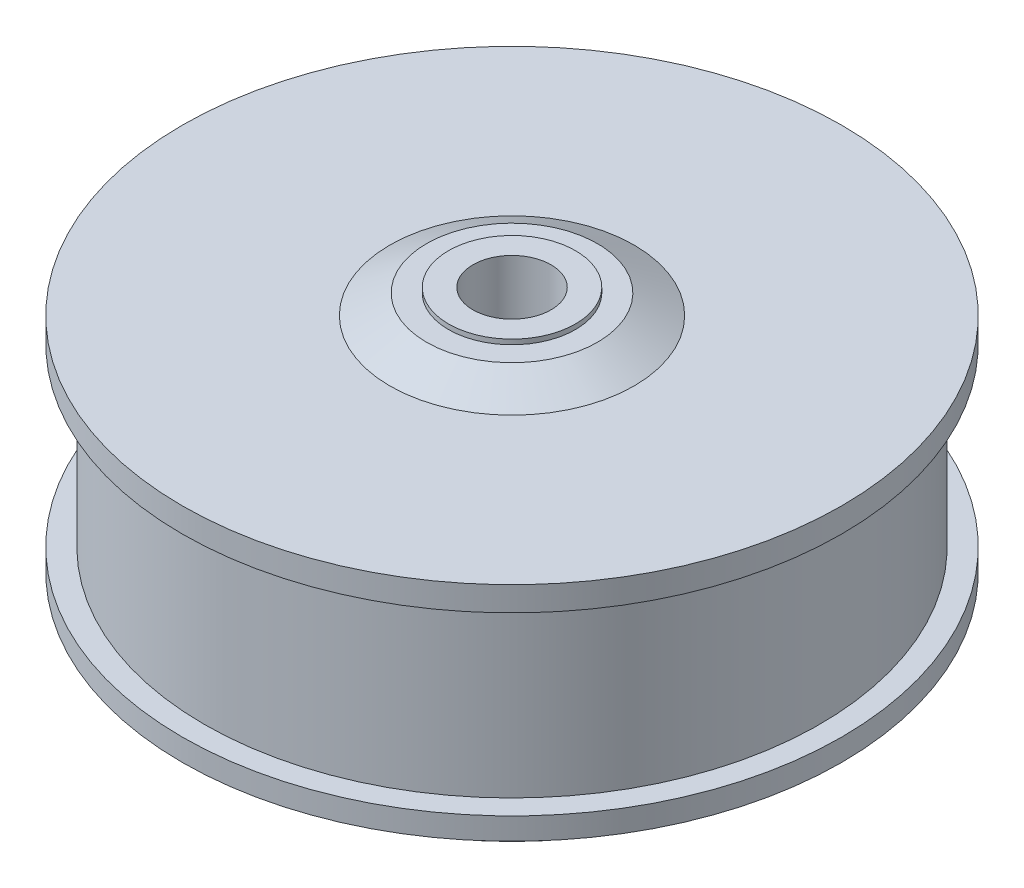
ISO-10303-21;
HEADER;
FILE_DESCRIPTION(('STEP AP214'),'2;1');
FILE_NAME('part.step','',(''),(''),'','','');
FILE_SCHEMA(('AUTOMOTIVE_DESIGN { 1 0 10303 214 1 1 1 1 }'));
ENDSEC;
DATA;
#1=APPLICATION_CONTEXT('core data for automotive mechanical design processes');
#2=APPLICATION_PROTOCOL_DEFINITION('international standard','automotive_design',2000,#1);
#3=PRODUCT_CONTEXT('',#1,'mechanical');
#4=PRODUCT('Part','Part','',(#3));
#5=PRODUCT_RELATED_PRODUCT_CATEGORY('part','',(#4));
#6=PRODUCT_DEFINITION_FORMATION('','',#4);
#7=PRODUCT_DEFINITION_CONTEXT('part definition',#1,'design');
#8=PRODUCT_DEFINITION('design','',#6,#7);
#9=PRODUCT_DEFINITION_SHAPE('','',#8);
#10=(LENGTH_UNIT() NAMED_UNIT(*) SI_UNIT(.MILLI.,.METRE.));
#11=(NAMED_UNIT(*) PLANE_ANGLE_UNIT() SI_UNIT($,.RADIAN.));
#12=(NAMED_UNIT(*) SI_UNIT($,.STERADIAN.) SOLID_ANGLE_UNIT());
#13=UNCERTAINTY_MEASURE_WITH_UNIT(LENGTH_MEASURE(1.E-05),#10,'distance_accuracy_value','');
#14=(GEOMETRIC_REPRESENTATION_CONTEXT(3) GLOBAL_UNCERTAINTY_ASSIGNED_CONTEXT((#13)) GLOBAL_UNIT_ASSIGNED_CONTEXT((#10,
#11,#12)) REPRESENTATION_CONTEXT('',''));
#15=CARTESIAN_POINT('',(0.,0.,0.));
#16=DIRECTION('',(0.,0.,1.));
#17=DIRECTION('',(1.,0.,0.));
#18=AXIS2_PLACEMENT_3D('',#15,#16,#17);
#19=CARTESIAN_POINT('',(13.,61.5,0.));
#20=DIRECTION('',(0.,-1.,0.));
#21=DIRECTION('',(0.,0.,-1.));
#22=AXIS2_PLACEMENT_3D('',#19,#20,#21);
#23=PLANE('',#22);
#24=CARTESIAN_POINT('',(0.,61.5,0.));
#25=DIRECTION('',(0.,1.,0.));
#26=DIRECTION('',(0.,0.,1.));
#27=AXIS2_PLACEMENT_3D('',#24,#25,#26);
#28=CIRCLE('',#27,7.99999999999999);
#29=CARTESIAN_POINT('',(0.,61.5,7.99999999999999));
#30=VERTEX_POINT('',#29);
#31=EDGE_CURVE('E10',#30,#30,#28,.T.);
#32=ORIENTED_EDGE('',*,*,#31,.F.);
#33=EDGE_LOOP('',(#32));
#34=FACE_BOUND('',#33,.T.);
#35=CARTESIAN_POINT('',(0.,61.5,0.));
#36=DIRECTION('',(0.,1.,0.));
#37=DIRECTION('',(0.,0.,1.));
#38=AXIS2_PLACEMENT_3D('',#35,#36,#37);
#39=CIRCLE('',#38,13.);
#40=CARTESIAN_POINT('',(0.,61.5,13.));
#41=VERTEX_POINT('',#40);
#42=EDGE_CURVE('E85',#41,#41,#39,.T.);
#43=ORIENTED_EDGE('',*,*,#42,.T.);
#44=EDGE_LOOP('',(#43));
#45=FACE_BOUND('',#44,.T.);
#46=ADVANCED_FACE('F39',(#34,#45),#23,.F.);
#47=CARTESIAN_POINT('',(0.,20.5,0.));
#48=DIRECTION('',(0.,1.,0.));
#49=DIRECTION('',(0.,0.,1.));
#50=AXIS2_PLACEMENT_3D('',#47,#48,#49);
#51=CYLINDRICAL_SURFACE('',#50,8.);
#52=CARTESIAN_POINT('',(0.,20.5,0.));
#53=DIRECTION('',(0.,1.,0.));
#54=DIRECTION('',(0.,0.,1.));
#55=AXIS2_PLACEMENT_3D('',#52,#53,#54);
#56=CIRCLE('',#55,8.);
#57=CARTESIAN_POINT('',(0.,20.5,8.));
#58=VERTEX_POINT('',#57);
#59=EDGE_CURVE('E45',#58,#58,#56,.T.);
#60=ORIENTED_EDGE('',*,*,#59,.F.);
#61=EDGE_LOOP('',(#60));
#62=FACE_BOUND('',#61,.T.);
#63=ORIENTED_EDGE('',*,*,#31,.T.);
#64=EDGE_LOOP('',(#63));
#65=FACE_BOUND('',#64,.T.);
#66=ADVANCED_FACE('F181',(#62,#65),#51,.F.);
#67=CARTESIAN_POINT('',(8.,20.5,0.));
#68=DIRECTION('',(0.,-1.,0.));
#69=DIRECTION('',(0.,0.,-1.));
#70=AXIS2_PLACEMENT_3D('',#67,#68,#69);
#71=PLANE('',#70);
#72=ORIENTED_EDGE('',*,*,#59,.T.);
#73=EDGE_LOOP('',(#72));
#74=FACE_BOUND('',#73,.T.);
#75=ADVANCED_FACE('F150',(#74),#71,.F.);
#76=CARTESIAN_POINT('',(52.,0.,0.));
#77=DIRECTION('',(0.,1.,0.));
#78=DIRECTION('',(0.,0.,1.));
#79=AXIS2_PLACEMENT_3D('',#76,#77,#78);
#80=PLANE('',#79);
#81=CARTESIAN_POINT('',(0.,0.,27.5));
#82=DIRECTION('',(0.,-1.,0.));
#83=DIRECTION('',(0.,0.,-1.));
#84=AXIS2_PLACEMENT_3D('',#81,#82,#83);
#85=CIRCLE('',#84,2.);
#86=CARTESIAN_POINT('',(0.,0.,25.5));
#87=VERTEX_POINT('',#86);
#88=EDGE_CURVE('E131',#87,#87,#85,.T.);
#89=ORIENTED_EDGE('',*,*,#88,.F.);
#90=EDGE_LOOP('',(#89));
#91=FACE_BOUND('',#90,.T.);
#92=CARTESIAN_POINT('',(19.4454364826301,0.,19.4454364826301));
#93=DIRECTION('',(0.,-1.,0.));
#94=DIRECTION('',(0.,0.,-1.));
#95=AXIS2_PLACEMENT_3D('',#92,#93,#94);
#96=CIRCLE('',#95,2.);
#97=CARTESIAN_POINT('',(19.4454364826301,0.,17.4454364826301));
#98=VERTEX_POINT('',#97);
#99=EDGE_CURVE('E128',#98,#98,#96,.T.);
#100=ORIENTED_EDGE('',*,*,#99,.F.);
#101=EDGE_LOOP('',(#100));
#102=FACE_BOUND('',#101,.T.);
#103=CARTESIAN_POINT('',(27.5,0.,0.));
#104=DIRECTION('',(0.,-1.,0.));
#105=DIRECTION('',(0.,0.,-1.));
#106=AXIS2_PLACEMENT_3D('',#103,#104,#105);
#107=CIRCLE('',#106,2.00000000000001);
#108=CARTESIAN_POINT('',(27.5,0.,-2.));
#109=VERTEX_POINT('',#108);
#110=EDGE_CURVE('E122',#109,#109,#107,.T.);
#111=ORIENTED_EDGE('',*,*,#110,.F.);
#112=EDGE_LOOP('',(#111));
#113=FACE_BOUND('',#112,.T.);
#114=CARTESIAN_POINT('',(19.4454364826301,0.,-19.4454364826301));
#115=DIRECTION('',(0.,-1.,0.));
#116=DIRECTION('',(0.,0.,-1.));
#117=AXIS2_PLACEMENT_3D('',#114,#115,#116);
#118=CIRCLE('',#117,2.);
#119=CARTESIAN_POINT('',(19.4454364826301,0.,-21.4454364826301));
#120=VERTEX_POINT('',#119);
#121=EDGE_CURVE('E116',#120,#120,#118,.T.);
#122=ORIENTED_EDGE('',*,*,#121,.F.);
#123=EDGE_LOOP('',(#122));
#124=FACE_BOUND('',#123,.T.);
#125=CARTESIAN_POINT('',(0.,0.,-27.5));
#126=DIRECTION('',(0.,-1.,0.));
#127=DIRECTION('',(0.,0.,-1.));
#128=AXIS2_PLACEMENT_3D('',#125,#126,#127);
#129=CIRCLE('',#128,2.);
#130=CARTESIAN_POINT('',(0.,0.,-29.5));
#131=VERTEX_POINT('',#130);
#132=EDGE_CURVE('E110',#131,#131,#129,.T.);
#133=ORIENTED_EDGE('',*,*,#132,.F.);
#134=EDGE_LOOP('',(#133));
#135=FACE_BOUND('',#134,.T.);
#136=CARTESIAN_POINT('',(-19.4454364826301,0.,-19.4454364826301));
#137=DIRECTION('',(0.,-1.,0.));
#138=DIRECTION('',(0.,0.,-1.));
#139=AXIS2_PLACEMENT_3D('',#136,#137,#138);
#140=CIRCLE('',#139,2.00000000000001);
#141=CARTESIAN_POINT('',(-19.4454364826301,0.,-21.4454364826301));
#142=VERTEX_POINT('',#141);
#143=EDGE_CURVE('E104',#142,#142,#140,.T.);
#144=ORIENTED_EDGE('',*,*,#143,.F.);
#145=EDGE_LOOP('',(#144));
#146=FACE_BOUND('',#145,.T.);
#147=CARTESIAN_POINT('',(-27.5,0.,0.));
#148=DIRECTION('',(0.,-1.,0.));
#149=DIRECTION('',(0.,0.,-1.));
#150=AXIS2_PLACEMENT_3D('',#147,#148,#149);
#151=CIRCLE('',#150,2.);
#152=CARTESIAN_POINT('',(-27.5,0.,-2.00000000000001));
#153=VERTEX_POINT('',#152);
#154=EDGE_CURVE('E98',#153,#153,#151,.T.);
#155=ORIENTED_EDGE('',*,*,#154,.F.);
#156=EDGE_LOOP('',(#155));
#157=FACE_BOUND('',#156,.T.);
#158=CARTESIAN_POINT('',(-19.4454364826301,0.,19.4454364826301));
#159=DIRECTION('',(0.,-1.,0.));
#160=DIRECTION('',(0.,0.,-1.));
#161=AXIS2_PLACEMENT_3D('',#158,#159,#160);
#162=CIRCLE('',#161,2.);
#163=CARTESIAN_POINT('',(-19.4454364826301,0.,17.4454364826301));
#164=VERTEX_POINT('',#163);
#165=EDGE_CURVE('E92',#164,#164,#162,.T.);
#166=ORIENTED_EDGE('',*,*,#165,.F.);
#167=EDGE_LOOP('',(#166));
#168=FACE_BOUND('',#167,.T.);
#169=CARTESIAN_POINT('',(0.,0.,0.));
#170=DIRECTION('',(0.,1.,0.));
#171=DIRECTION('',(0.,0.,1.));
#172=AXIS2_PLACEMENT_3D('',#169,#170,#171);
#173=CIRCLE('',#172,52.);
#174=CARTESIAN_POINT('',(0.,0.,52.));
#175=VERTEX_POINT('',#174);
#176=EDGE_CURVE('E49',#175,#175,#173,.T.);
#177=ORIENTED_EDGE('',*,*,#176,.F.);
#178=EDGE_LOOP('',(#177));
#179=FACE_BOUND('',#178,.T.);
#180=ADVANCED_FACE('F146',(#91,#102,#113,#124,#135,#146,#157,#168,#179),#80,.F.);
#181=CARTESIAN_POINT('',(0.,0.,0.));
#182=DIRECTION('',(0.,1.,0.));
#183=DIRECTION('',(0.,0.,1.));
#184=AXIS2_PLACEMENT_3D('',#181,#182,#183);
#185=CONICAL_SURFACE('',#184,52.,0.712357598094328);
#186=CARTESIAN_POINT('',(0.,11.,0.));
#187=DIRECTION('',(0.,1.,0.));
#188=DIRECTION('',(0.,0.,1.));
#189=AXIS2_PLACEMENT_3D('',#186,#187,#188);
#190=CIRCLE('',#189,61.5);
#191=CARTESIAN_POINT('',(0.,11.,61.5));
#192=VERTEX_POINT('',#191);
#193=EDGE_CURVE('E53',#192,#192,#190,.T.);
#194=ORIENTED_EDGE('',*,*,#193,.F.);
#195=EDGE_LOOP('',(#194));
#196=FACE_BOUND('',#195,.T.);
#197=ORIENTED_EDGE('',*,*,#176,.T.);
#198=EDGE_LOOP('',(#197));
#199=FACE_BOUND('',#198,.T.);
#200=ADVANCED_FACE('F149',(#196,#199),#185,.T.);
#201=CARTESIAN_POINT('',(67.5,11.,0.));
#202=DIRECTION('',(0.,1.,0.));
#203=DIRECTION('',(0.,0.,1.));
#204=AXIS2_PLACEMENT_3D('',#201,#202,#203);
#205=PLANE('',#204);
#206=CARTESIAN_POINT('',(0.,11.,0.));
#207=DIRECTION('',(0.,1.,0.));
#208=DIRECTION('',(0.,0.,1.));
#209=AXIS2_PLACEMENT_3D('',#206,#207,#208);
#210=CIRCLE('',#209,67.5);
#211=CARTESIAN_POINT('',(0.,11.,67.5));
#212=VERTEX_POINT('',#211);
#213=EDGE_CURVE('E58',#212,#212,#210,.T.);
#214=ORIENTED_EDGE('',*,*,#213,.F.);
#215=EDGE_LOOP('',(#214));
#216=FACE_BOUND('',#215,.T.);
#217=ORIENTED_EDGE('',*,*,#193,.T.);
#218=EDGE_LOOP('',(#217));
#219=FACE_BOUND('',#218,.T.);
#220=ADVANCED_FACE('F169',(#216,#219),#205,.F.);
#221=CARTESIAN_POINT('',(0.,20.5,0.));
#222=DIRECTION('',(0.,1.,0.));
#223=DIRECTION('',(0.,0.,1.));
#224=AXIS2_PLACEMENT_3D('',#221,#222,#223);
#225=CYLINDRICAL_SURFACE('',#224,67.5);
#226=CARTESIAN_POINT('',(0.,15.5,0.));
#227=DIRECTION('',(0.,1.,0.));
#228=DIRECTION('',(0.,0.,1.));
#229=AXIS2_PLACEMENT_3D('',#226,#227,#228);
#230=CIRCLE('',#229,67.5);
#231=CARTESIAN_POINT('',(0.,15.5,67.5));
#232=VERTEX_POINT('',#231);
#233=EDGE_CURVE('E61',#232,#232,#230,.T.);
#234=ORIENTED_EDGE('',*,*,#233,.F.);
#235=EDGE_LOOP('',(#234));
#236=FACE_BOUND('',#235,.T.);
#237=ORIENTED_EDGE('',*,*,#213,.T.);
#238=EDGE_LOOP('',(#237));
#239=FACE_BOUND('',#238,.T.);
#240=ADVANCED_FACE('F176',(#236,#239),#225,.T.);
#241=CARTESIAN_POINT('',(63.0000000000001,15.5,0.));
#242=DIRECTION('',(0.,-1.,0.));
#243=DIRECTION('',(0.,0.,-1.));
#244=AXIS2_PLACEMENT_3D('',#241,#242,#243);
#245=PLANE('',#244);
#246=CARTESIAN_POINT('',(0.,15.5,0.));
#247=DIRECTION('',(0.,1.,0.));
#248=DIRECTION('',(0.,0.,1.));
#249=AXIS2_PLACEMENT_3D('',#246,#247,#248);
#250=CIRCLE('',#249,63.0000000000001);
#251=CARTESIAN_POINT('',(0.,15.5,63.0000000000001));
#252=VERTEX_POINT('',#251);
#253=EDGE_CURVE('E64',#252,#252,#250,.T.);
#254=ORIENTED_EDGE('',*,*,#253,.F.);
#255=EDGE_LOOP('',(#254));
#256=FACE_BOUND('',#255,.T.);
#257=ORIENTED_EDGE('',*,*,#233,.T.);
#258=EDGE_LOOP('',(#257));
#259=FACE_BOUND('',#258,.T.);
#260=ADVANCED_FACE('F230',(#256,#259),#245,.F.);
#261=CARTESIAN_POINT('',(0.,20.5,0.));
#262=DIRECTION('',(0.,1.,0.));
#263=DIRECTION('',(0.,0.,1.));
#264=AXIS2_PLACEMENT_3D('',#261,#262,#263);
#265=CYLINDRICAL_SURFACE('',#264,63.0000000000001);
#266=CARTESIAN_POINT('',(0.,51.5,0.));
#267=DIRECTION('',(0.,1.,0.));
#268=DIRECTION('',(0.,0.,1.));
#269=AXIS2_PLACEMENT_3D('',#266,#267,#268);
#270=CIRCLE('',#269,63.0000000000001);
#271=CARTESIAN_POINT('',(0.,51.5,63.0000000000001));
#272=VERTEX_POINT('',#271);
#273=EDGE_CURVE('E67',#272,#272,#270,.T.);
#274=ORIENTED_EDGE('',*,*,#273,.F.);
#275=EDGE_LOOP('',(#274));
#276=FACE_BOUND('',#275,.T.);
#277=ORIENTED_EDGE('',*,*,#253,.T.);
#278=EDGE_LOOP('',(#277));
#279=FACE_BOUND('',#278,.T.);
#280=ADVANCED_FACE('F224',(#276,#279),#265,.T.);
#281=CARTESIAN_POINT('',(67.5,51.5,0.));
#282=DIRECTION('',(0.,1.,0.));
#283=DIRECTION('',(0.,0.,1.));
#284=AXIS2_PLACEMENT_3D('',#281,#282,#283);
#285=PLANE('',#284);
#286=CARTESIAN_POINT('',(0.,51.5,0.));
#287=DIRECTION('',(0.,1.,0.));
#288=DIRECTION('',(0.,0.,1.));
#289=AXIS2_PLACEMENT_3D('',#286,#287,#288);
#290=CIRCLE('',#289,67.5);
#291=CARTESIAN_POINT('',(0.,51.5,67.5));
#292=VERTEX_POINT('',#291);
#293=EDGE_CURVE('E70',#292,#292,#290,.T.);
#294=ORIENTED_EDGE('',*,*,#293,.F.);
#295=EDGE_LOOP('',(#294));
#296=FACE_BOUND('',#295,.T.);
#297=ORIENTED_EDGE('',*,*,#273,.T.);
#298=EDGE_LOOP('',(#297));
#299=FACE_BOUND('',#298,.T.);
#300=ADVANCED_FACE('F218',(#296,#299),#285,.F.);
#301=CARTESIAN_POINT('',(0.,20.5,0.));
#302=DIRECTION('',(0.,1.,0.));
#303=DIRECTION('',(0.,0.,1.));
#304=AXIS2_PLACEMENT_3D('',#301,#302,#303);
#305=CYLINDRICAL_SURFACE('',#304,67.5);
#306=CARTESIAN_POINT('',(0.,56.5,0.));
#307=DIRECTION('',(0.,1.,0.));
#308=DIRECTION('',(0.,0.,1.));
#309=AXIS2_PLACEMENT_3D('',#306,#307,#308);
#310=CIRCLE('',#309,67.5);
#311=CARTESIAN_POINT('',(0.,56.5,67.5));
#312=VERTEX_POINT('',#311);
#313=EDGE_CURVE('E73',#312,#312,#310,.T.);
#314=ORIENTED_EDGE('',*,*,#313,.F.);
#315=EDGE_LOOP('',(#314));
#316=FACE_BOUND('',#315,.T.);
#317=ORIENTED_EDGE('',*,*,#293,.T.);
#318=EDGE_LOOP('',(#317));
#319=FACE_BOUND('',#318,.T.);
#320=ADVANCED_FACE('F212',(#316,#319),#305,.T.);
#321=CARTESIAN_POINT('',(25.,56.5,0.));
#322=DIRECTION('',(0.,-1.,0.));
#323=DIRECTION('',(0.,0.,-1.));
#324=AXIS2_PLACEMENT_3D('',#321,#322,#323);
#325=PLANE('',#324);
#326=CARTESIAN_POINT('',(0.,56.5,0.));
#327=DIRECTION('',(0.,1.,0.));
#328=DIRECTION('',(0.,0.,1.));
#329=AXIS2_PLACEMENT_3D('',#326,#327,#328);
#330=CIRCLE('',#329,25.);
#331=CARTESIAN_POINT('',(0.,56.5,25.));
#332=VERTEX_POINT('',#331);
#333=EDGE_CURVE('E76',#332,#332,#330,.T.);
#334=ORIENTED_EDGE('',*,*,#333,.F.);
#335=EDGE_LOOP('',(#334));
#336=FACE_BOUND('',#335,.T.);
#337=ORIENTED_EDGE('',*,*,#313,.T.);
#338=EDGE_LOOP('',(#337));
#339=FACE_BOUND('',#338,.T.);
#340=ADVANCED_FACE('F206',(#336,#339),#325,.F.);
#341=CARTESIAN_POINT('',(0.,56.5,0.));
#342=DIRECTION('',(0.,-1.,0.));
#343=DIRECTION('',(0.,0.,-1.));
#344=AXIS2_PLACEMENT_3D('',#341,#342,#343);
#345=CONICAL_SURFACE('',#344,25.,1.08083900054117);
#346=CARTESIAN_POINT('',(0.,60.5,0.));
#347=DIRECTION('',(0.,1.,0.));
#348=DIRECTION('',(0.,0.,1.));
#349=AXIS2_PLACEMENT_3D('',#346,#347,#348);
#350=CIRCLE('',#349,17.5);
#351=CARTESIAN_POINT('',(0.,60.5,17.5));
#352=VERTEX_POINT('',#351);
#353=EDGE_CURVE('E79',#352,#352,#350,.T.);
#354=ORIENTED_EDGE('',*,*,#353,.F.);
#355=EDGE_LOOP('',(#354));
#356=FACE_BOUND('',#355,.T.);
#357=ORIENTED_EDGE('',*,*,#333,.T.);
#358=EDGE_LOOP('',(#357));
#359=FACE_BOUND('',#358,.T.);
#360=ADVANCED_FACE('F200',(#356,#359),#345,.T.);
#361=CARTESIAN_POINT('',(17.5,60.5,0.));
#362=DIRECTION('',(0.,-1.,0.));
#363=DIRECTION('',(0.,0.,-1.));
#364=AXIS2_PLACEMENT_3D('',#361,#362,#363);
#365=PLANE('',#364);
#366=CARTESIAN_POINT('',(0.,60.5,0.));
#367=DIRECTION('',(0.,1.,0.));
#368=DIRECTION('',(0.,0.,1.));
#369=AXIS2_PLACEMENT_3D('',#366,#367,#368);
#370=CIRCLE('',#369,13.);
#371=CARTESIAN_POINT('',(0.,60.5,13.));
#372=VERTEX_POINT('',#371);
#373=EDGE_CURVE('E82',#372,#372,#370,.T.);
#374=ORIENTED_EDGE('',*,*,#373,.F.);
#375=EDGE_LOOP('',(#374));
#376=FACE_BOUND('',#375,.T.);
#377=ORIENTED_EDGE('',*,*,#353,.T.);
#378=EDGE_LOOP('',(#377));
#379=FACE_BOUND('',#378,.T.);
#380=ADVANCED_FACE('F194',(#376,#379),#365,.F.);
#381=CARTESIAN_POINT('',(0.,20.5,0.));
#382=DIRECTION('',(0.,1.,0.));
#383=DIRECTION('',(0.,0.,1.));
#384=AXIS2_PLACEMENT_3D('',#381,#382,#383);
#385=CYLINDRICAL_SURFACE('',#384,13.);
#386=ORIENTED_EDGE('',*,*,#42,.F.);
#387=EDGE_LOOP('',(#386));
#388=FACE_BOUND('',#387,.T.);
#389=ORIENTED_EDGE('',*,*,#373,.T.);
#390=EDGE_LOOP('',(#389));
#391=FACE_BOUND('',#390,.T.);
#392=ADVANCED_FACE('F190',(#388,#391),#385,.T.);
#393=CARTESIAN_POINT('',(-19.4454364826301,10.,19.4454364826301));
#394=DIRECTION('',(0.,-1.,0.));
#395=DIRECTION('',(0.,0.,-1.));
#396=AXIS2_PLACEMENT_3D('',#393,#394,#395);
#397=CYLINDRICAL_SURFACE('',#396,2.);
#398=CARTESIAN_POINT('',(-19.4454364826301,10.,19.4454364826301));
#399=DIRECTION('',(0.,-1.,0.));
#400=DIRECTION('',(0.,0.,-1.));
#401=AXIS2_PLACEMENT_3D('',#398,#399,#400);
#402=CIRCLE('',#401,2.);
#403=CARTESIAN_POINT('',(-19.4454364826301,10.,17.4454364826301));
#404=VERTEX_POINT('',#403);
#405=EDGE_CURVE('E89',#404,#404,#402,.T.);
#406=ORIENTED_EDGE('',*,*,#405,.F.);
#407=EDGE_LOOP('',(#406));
#408=FACE_BOUND('',#407,.T.);
#409=ORIENTED_EDGE('',*,*,#165,.T.);
#410=EDGE_LOOP('',(#409));
#411=FACE_BOUND('',#410,.T.);
#412=ADVANCED_FACE('F193',(#408,#411),#397,.F.);
#413=CARTESIAN_POINT('',(-19.4454364826301,10.,19.4454364826301));
#414=DIRECTION('',(0.,-1.,0.));
#415=DIRECTION('',(0.,0.,-1.));
#416=AXIS2_PLACEMENT_3D('',#413,#414,#415);
#417=PLANE('',#416);
#418=ORIENTED_EDGE('',*,*,#405,.T.);
#419=EDGE_LOOP('',(#418));
#420=FACE_BOUND('',#419,.T.);
#421=ADVANCED_FACE('F247',(#420),#417,.T.);
#422=CARTESIAN_POINT('',(-27.5,10.,0.));
#423=DIRECTION('',(0.,-1.,0.));
#424=DIRECTION('',(0.,0.,-1.));
#425=AXIS2_PLACEMENT_3D('',#422,#423,#424);
#426=CYLINDRICAL_SURFACE('',#425,2.);
#427=CARTESIAN_POINT('',(-27.5,10.,0.));
#428=DIRECTION('',(0.,-1.,0.));
#429=DIRECTION('',(0.,0.,-1.));
#430=AXIS2_PLACEMENT_3D('',#427,#428,#429);
#431=CIRCLE('',#430,2.);
#432=CARTESIAN_POINT('',(-27.5,10.,-2.00000000000001));
#433=VERTEX_POINT('',#432);
#434=EDGE_CURVE('E95',#433,#433,#431,.T.);
#435=ORIENTED_EDGE('',*,*,#434,.F.);
#436=EDGE_LOOP('',(#435));
#437=FACE_BOUND('',#436,.T.);
#438=ORIENTED_EDGE('',*,*,#154,.T.);
#439=EDGE_LOOP('',(#438));
#440=FACE_BOUND('',#439,.T.);
#441=ADVANCED_FACE('F250',(#437,#440),#426,.F.);
#442=CARTESIAN_POINT('',(-27.5,10.,0.));
#443=DIRECTION('',(0.,-1.,0.));
#444=DIRECTION('',(0.,0.,-1.));
#445=AXIS2_PLACEMENT_3D('',#442,#443,#444);
#446=PLANE('',#445);
#447=ORIENTED_EDGE('',*,*,#434,.T.);
#448=EDGE_LOOP('',(#447));
#449=FACE_BOUND('',#448,.T.);
#450=ADVANCED_FACE('F255',(#449),#446,.T.);
#451=CARTESIAN_POINT('',(-19.4454364826301,10.,-19.4454364826301));
#452=DIRECTION('',(0.,-1.,0.));
#453=DIRECTION('',(0.,0.,-1.));
#454=AXIS2_PLACEMENT_3D('',#451,#452,#453);
#455=CYLINDRICAL_SURFACE('',#454,2.00000000000001);
#456=CARTESIAN_POINT('',(-19.4454364826301,10.,-19.4454364826301));
#457=DIRECTION('',(0.,-1.,0.));
#458=DIRECTION('',(0.,0.,-1.));
#459=AXIS2_PLACEMENT_3D('',#456,#457,#458);
#460=CIRCLE('',#459,2.00000000000001);
#461=CARTESIAN_POINT('',(-19.4454364826301,10.,-21.4454364826301));
#462=VERTEX_POINT('',#461);
#463=EDGE_CURVE('E101',#462,#462,#460,.T.);
#464=ORIENTED_EDGE('',*,*,#463,.F.);
#465=EDGE_LOOP('',(#464));
#466=FACE_BOUND('',#465,.T.);
#467=ORIENTED_EDGE('',*,*,#143,.T.);
#468=EDGE_LOOP('',(#467));
#469=FACE_BOUND('',#468,.T.);
#470=ADVANCED_FACE('F258',(#466,#469),#455,.F.);
#471=CARTESIAN_POINT('',(-19.4454364826301,10.,-19.4454364826301));
#472=DIRECTION('',(0.,-1.,0.));
#473=DIRECTION('',(0.,0.,-1.));
#474=AXIS2_PLACEMENT_3D('',#471,#472,#473);
#475=PLANE('',#474);
#476=ORIENTED_EDGE('',*,*,#463,.T.);
#477=EDGE_LOOP('',(#476));
#478=FACE_BOUND('',#477,.T.);
#479=ADVANCED_FACE('F263',(#478),#475,.T.);
#480=CARTESIAN_POINT('',(0.,10.,-27.5));
#481=DIRECTION('',(0.,-1.,0.));
#482=DIRECTION('',(0.,0.,-1.));
#483=AXIS2_PLACEMENT_3D('',#480,#481,#482);
#484=CYLINDRICAL_SURFACE('',#483,2.);
#485=CARTESIAN_POINT('',(0.,10.,-27.5));
#486=DIRECTION('',(0.,-1.,0.));
#487=DIRECTION('',(0.,0.,-1.));
#488=AXIS2_PLACEMENT_3D('',#485,#486,#487);
#489=CIRCLE('',#488,2.);
#490=CARTESIAN_POINT('',(0.,10.,-29.5));
#491=VERTEX_POINT('',#490);
#492=EDGE_CURVE('E107',#491,#491,#489,.T.);
#493=ORIENTED_EDGE('',*,*,#492,.F.);
#494=EDGE_LOOP('',(#493));
#495=FACE_BOUND('',#494,.T.);
#496=ORIENTED_EDGE('',*,*,#132,.T.);
#497=EDGE_LOOP('',(#496));
#498=FACE_BOUND('',#497,.T.);
#499=ADVANCED_FACE('F266',(#495,#498),#484,.F.);
#500=CARTESIAN_POINT('',(0.,10.,-27.5));
#501=DIRECTION('',(0.,-1.,0.));
#502=DIRECTION('',(0.,0.,-1.));
#503=AXIS2_PLACEMENT_3D('',#500,#501,#502);
#504=PLANE('',#503);
#505=ORIENTED_EDGE('',*,*,#492,.T.);
#506=EDGE_LOOP('',(#505));
#507=FACE_BOUND('',#506,.T.);
#508=ADVANCED_FACE('F271',(#507),#504,.T.);
#509=CARTESIAN_POINT('',(19.4454364826301,10.,-19.4454364826301));
#510=DIRECTION('',(0.,-1.,0.));
#511=DIRECTION('',(0.,0.,-1.));
#512=AXIS2_PLACEMENT_3D('',#509,#510,#511);
#513=CYLINDRICAL_SURFACE('',#512,2.);
#514=CARTESIAN_POINT('',(19.4454364826301,10.,-19.4454364826301));
#515=DIRECTION('',(0.,-1.,0.));
#516=DIRECTION('',(0.,0.,-1.));
#517=AXIS2_PLACEMENT_3D('',#514,#515,#516);
#518=CIRCLE('',#517,2.);
#519=CARTESIAN_POINT('',(19.4454364826301,10.,-21.4454364826301));
#520=VERTEX_POINT('',#519);
#521=EDGE_CURVE('E113',#520,#520,#518,.T.);
#522=ORIENTED_EDGE('',*,*,#521,.F.);
#523=EDGE_LOOP('',(#522));
#524=FACE_BOUND('',#523,.T.);
#525=ORIENTED_EDGE('',*,*,#121,.T.);
#526=EDGE_LOOP('',(#525));
#527=FACE_BOUND('',#526,.T.);
#528=ADVANCED_FACE('F274',(#524,#527),#513,.F.);
#529=CARTESIAN_POINT('',(19.4454364826301,10.,-19.4454364826301));
#530=DIRECTION('',(0.,-1.,0.));
#531=DIRECTION('',(0.,0.,-1.));
#532=AXIS2_PLACEMENT_3D('',#529,#530,#531);
#533=PLANE('',#532);
#534=ORIENTED_EDGE('',*,*,#521,.T.);
#535=EDGE_LOOP('',(#534));
#536=FACE_BOUND('',#535,.T.);
#537=ADVANCED_FACE('F279',(#536),#533,.T.);
#538=CARTESIAN_POINT('',(27.5,10.,0.));
#539=DIRECTION('',(0.,-1.,0.));
#540=DIRECTION('',(0.,0.,-1.));
#541=AXIS2_PLACEMENT_3D('',#538,#539,#540);
#542=CYLINDRICAL_SURFACE('',#541,2.00000000000001);
#543=CARTESIAN_POINT('',(27.5,10.,0.));
#544=DIRECTION('',(0.,-1.,0.));
#545=DIRECTION('',(0.,0.,-1.));
#546=AXIS2_PLACEMENT_3D('',#543,#544,#545);
#547=CIRCLE('',#546,2.00000000000001);
#548=CARTESIAN_POINT('',(27.5,10.,-2.));
#549=VERTEX_POINT('',#548);
#550=EDGE_CURVE('E119',#549,#549,#547,.T.);
#551=ORIENTED_EDGE('',*,*,#550,.F.);
#552=EDGE_LOOP('',(#551));
#553=FACE_BOUND('',#552,.T.);
#554=ORIENTED_EDGE('',*,*,#110,.T.);
#555=EDGE_LOOP('',(#554));
#556=FACE_BOUND('',#555,.T.);
#557=ADVANCED_FACE('F282',(#553,#556),#542,.F.);
#558=CARTESIAN_POINT('',(27.5,10.,0.));
#559=DIRECTION('',(0.,-1.,0.));
#560=DIRECTION('',(0.,0.,-1.));
#561=AXIS2_PLACEMENT_3D('',#558,#559,#560);
#562=PLANE('',#561);
#563=ORIENTED_EDGE('',*,*,#550,.T.);
#564=EDGE_LOOP('',(#563));
#565=FACE_BOUND('',#564,.T.);
#566=ADVANCED_FACE('F287',(#565),#562,.T.);
#567=CARTESIAN_POINT('',(19.4454364826301,10.,19.4454364826301));
#568=DIRECTION('',(0.,-1.,0.));
#569=DIRECTION('',(0.,0.,-1.));
#570=AXIS2_PLACEMENT_3D('',#567,#568,#569);
#571=CYLINDRICAL_SURFACE('',#570,2.);
#572=CARTESIAN_POINT('',(19.4454364826301,10.,19.4454364826301));
#573=DIRECTION('',(0.,-1.,0.));
#574=DIRECTION('',(0.,0.,-1.));
#575=AXIS2_PLACEMENT_3D('',#572,#573,#574);
#576=CIRCLE('',#575,2.);
#577=CARTESIAN_POINT('',(19.4454364826301,10.,17.4454364826301));
#578=VERTEX_POINT('',#577);
#579=EDGE_CURVE('E125',#578,#578,#576,.T.);
#580=ORIENTED_EDGE('',*,*,#579,.F.);
#581=EDGE_LOOP('',(#580));
#582=FACE_BOUND('',#581,.T.);
#583=ORIENTED_EDGE('',*,*,#99,.T.);
#584=EDGE_LOOP('',(#583));
#585=FACE_BOUND('',#584,.T.);
#586=ADVANCED_FACE('F290',(#582,#585),#571,.F.);
#587=CARTESIAN_POINT('',(19.4454364826301,10.,19.4454364826301));
#588=DIRECTION('',(0.,-1.,0.));
#589=DIRECTION('',(0.,0.,-1.));
#590=AXIS2_PLACEMENT_3D('',#587,#588,#589);
#591=PLANE('',#590);
#592=ORIENTED_EDGE('',*,*,#579,.T.);
#593=EDGE_LOOP('',(#592));
#594=FACE_BOUND('',#593,.T.);
#595=ADVANCED_FACE('F142',(#594),#591,.T.);
#596=CARTESIAN_POINT('',(0.,10.,27.5));
#597=DIRECTION('',(0.,-1.,0.));
#598=DIRECTION('',(0.,0.,-1.));
#599=AXIS2_PLACEMENT_3D('',#596,#597,#598);
#600=CYLINDRICAL_SURFACE('',#599,2.);
#601=CARTESIAN_POINT('',(0.,10.,27.5));
#602=DIRECTION('',(0.,-1.,0.));
#603=DIRECTION('',(0.,0.,-1.));
#604=AXIS2_PLACEMENT_3D('',#601,#602,#603);
#605=CIRCLE('',#604,2.);
#606=CARTESIAN_POINT('',(0.,10.,25.5));
#607=VERTEX_POINT('',#606);
#608=EDGE_CURVE('E88',#607,#607,#605,.T.);
#609=ORIENTED_EDGE('',*,*,#608,.F.);
#610=EDGE_LOOP('',(#609));
#611=FACE_BOUND('',#610,.T.);
#612=ORIENTED_EDGE('',*,*,#88,.T.);
#613=EDGE_LOOP('',(#612));
#614=FACE_BOUND('',#613,.T.);
#615=ADVANCED_FACE('F139',(#611,#614),#600,.F.);
#616=CARTESIAN_POINT('',(0.,10.,27.5));
#617=DIRECTION('',(0.,-1.,0.));
#618=DIRECTION('',(0.,0.,-1.));
#619=AXIS2_PLACEMENT_3D('',#616,#617,#618);
#620=PLANE('',#619);
#621=ORIENTED_EDGE('',*,*,#608,.T.);
#622=EDGE_LOOP('',(#621));
#623=FACE_BOUND('',#622,.T.);
#624=ADVANCED_FACE('F137',(#623),#620,.T.);
#625=CLOSED_SHELL('',(#46,#66,#75,#180,#200,#220,#240,#260,#280,#300,#320,#340,#360,#380,#392,
#412,#421,#441,#450,#470,#479,#499,#508,#528,#537,#557,#566,#586,#595,#615,#624));
#626=MANIFOLD_SOLID_BREP('B2',#625);
#627=ADVANCED_BREP_SHAPE_REPRESENTATION('',(#18,#626),#14);
#628=SHAPE_DEFINITION_REPRESENTATION(#9,#627);
ENDSEC;
END-ISO-10303-21;
